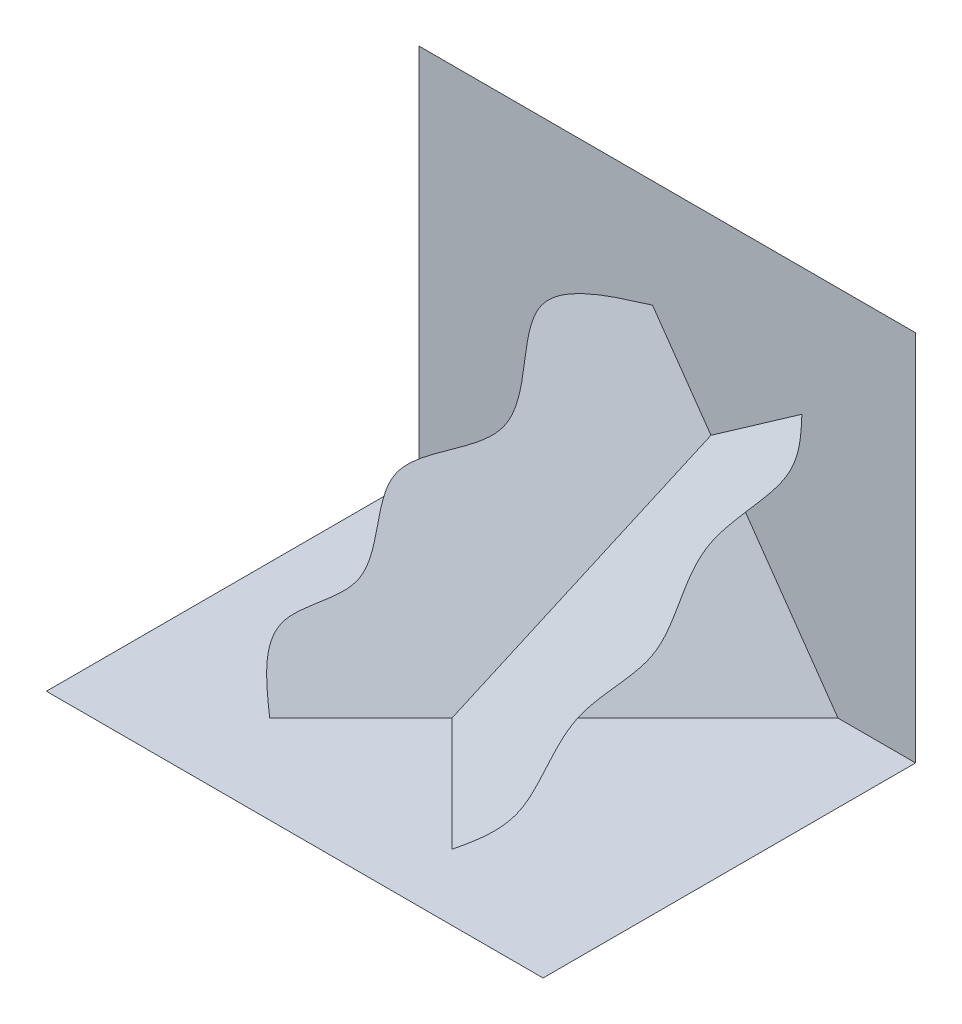
ISO-10303-21;
HEADER;
FILE_DESCRIPTION(('STEP AP214'),'2;1');
FILE_NAME('part.step','',(''),(''),'','','');
FILE_SCHEMA(('AUTOMOTIVE_DESIGN { 1 0 10303 214 1 1 1 1 }'));
ENDSEC;
DATA;
#1=APPLICATION_CONTEXT('core data for automotive mechanical design processes');
#2=APPLICATION_PROTOCOL_DEFINITION('international standard','automotive_design',2000,#1);
#3=PRODUCT_CONTEXT('',#1,'mechanical');
#4=PRODUCT('Part','Part','',(#3));
#5=PRODUCT_RELATED_PRODUCT_CATEGORY('part','',(#4));
#6=PRODUCT_DEFINITION_FORMATION('','',#4);
#7=PRODUCT_DEFINITION_CONTEXT('part definition',#1,'design');
#8=PRODUCT_DEFINITION('design','',#6,#7);
#9=PRODUCT_DEFINITION_SHAPE('','',#8);
#10=(LENGTH_UNIT() NAMED_UNIT(*) SI_UNIT(.MILLI.,.METRE.));
#11=(NAMED_UNIT(*) PLANE_ANGLE_UNIT() SI_UNIT($,.RADIAN.));
#12=(NAMED_UNIT(*) SI_UNIT($,.STERADIAN.) SOLID_ANGLE_UNIT());
#13=UNCERTAINTY_MEASURE_WITH_UNIT(LENGTH_MEASURE(1.E-05),#10,'distance_accuracy_value','');
#14=(GEOMETRIC_REPRESENTATION_CONTEXT(3) GLOBAL_UNCERTAINTY_ASSIGNED_CONTEXT((#13)) GLOBAL_UNIT_ASSIGNED_CONTEXT((#10,
#11,#12)) REPRESENTATION_CONTEXT('',''));
#15=CARTESIAN_POINT('',(0.,0.,0.));
#16=DIRECTION('',(0.,0.,1.));
#17=DIRECTION('',(1.,0.,0.));
#18=AXIS2_PLACEMENT_3D('',#15,#16,#17);
#19=CARTESIAN_POINT('',(-66.2620458647592,26.8489548000047,3.35814875180777));
#20=DIRECTION('',(0.241844762647977,0.664463024388675,-0.707106781186547));
#21=DIRECTION('',(0.,0.728739444818682,0.684791078771737));
#22=AXIS2_PLACEMENT_3D('',#19,#20,#21);
#23=PLANE('',#22);
#24=DIRECTION('',(-0.970314954424461,0.165613135909002,-0.176241818064393));
#25=VECTOR('',#24,1.);
#26=CARTESIAN_POINT('',(32.8254825642083,14.5762783450916,25.7155359248949));
#27=LINE('',#26,#25);
#28=CARTESIAN_POINT('',(32.8254825642083,14.5762783450916,25.7155359248949));
#29=VERTEX_POINT('',#28);
#30=CARTESIAN_POINT('',(-35.9189228439686,26.3095578374199,13.2292406909118));
#31=VERTEX_POINT('',#30);
#32=EDGE_CURVE('E81',#29,#31,#27,.T.);
#33=ORIENTED_EDGE('',*,*,#32,.T.);
#34=DIRECTION('',(0.833043972934897,0.231487773097027,0.502445171201219));
#35=VECTOR('',#34,1.);
#36=CARTESIAN_POINT('',(-35.9189228439686,26.3095578374199,13.2292406909118));
#37=LINE('',#36,#35);
#38=CARTESIAN_POINT('',(4.69642747711097,37.5958251952621,37.726130781331));
#39=VERTEX_POINT('',#38);
#40=EDGE_CURVE('E77',#31,#39,#37,.T.);
#41=ORIENTED_EDGE('',*,*,#40,.T.);
#42=DIRECTION('',(0.734813955546227,-0.601338517183763,-0.313752192798299));
#43=VECTOR('',#42,1.);
#44=CARTESIAN_POINT('',(4.69642747711098,37.5958251952621,37.726130781331));
#45=LINE('',#44,#43);
#46=EDGE_CURVE('E14',#39,#29,#45,.T.);
#47=ORIENTED_EDGE('',*,*,#46,.T.);
#48=EDGE_LOOP('',(#33,#41,#47));
#49=FACE_BOUND('',#48,.T.);
#50=ADVANCED_FACE('F71',(#49),#23,.T.);
#51=OPEN_SHELL('',(#50));
#52=SHELL_BASED_SURFACE_MODEL('B2',(#51));
#53=CARTESIAN_POINT('',(36.7570789771264,0.,123.479185095785));
#54=DIRECTION('',(0.497542812164521,-0.710564775461631,-0.497542812164523));
#55=DIRECTION('',(0.109657042945056,0.62049687008648,-0.776504325258674));
#56=AXIS2_PLACEMENT_3D('',#53,#54,#55);
#57=PLANE('',#56);
#58=CARTESIAN_POINT('',(36.7570789771264,0.,123.479185095785));
#59=CARTESIAN_POINT('',(45.7935676640745,7.12507062023506,122.340018378547));
#60=CARTESIAN_POINT('',(64.6600893419616,22.0009039189917,119.961648382187));
#61=CARTESIAN_POINT('',(42.1865609116284,31.7775381264274,83.5256392958579));
#62=CARTESIAN_POINT('',(65.4995856832867,51.5763304877276,78.5630582208244));
#63=CARTESIAN_POINT('',(66.0684059283905,57.3378239376939,70.903613079501));
#64=CARTESIAN_POINT('',(65.8490950029996,63.8778359657677,61.344197012147));
#65=CARTESIAN_POINT('',(42.5836374044887,66.33905750005,34.5637507853));
#66=CARTESIAN_POINT('',(77.3757496770937,97.9750823769855,24.1749371886657));
#67=CARTESIAN_POINT('',(61.3846483981035,98.4551408340038,7.49824138116505));
#68=CARTESIAN_POINT('',(54.1946667180037,98.670986600416,0.));
#69=B_SPLINE_CURVE_WITH_KNOTS('',3,(#58,#59,#60,#61,#62,#63,#64,#65,#66,#67,#68),.UNSPECIFIED.,
.F.,.F.,(4,1,1,1,2,1,1,4),(0.,0.154499840866,0.322567171598255,0.486588524749698,0.5,
0.698619407107819,0.864492075697165,1.),.UNSPECIFIED.);
#70=CARTESIAN_POINT('',(54.1946667180038,98.670986600416,0.));
#71=VERTEX_POINT('',#70);
#72=CARTESIAN_POINT('',(36.7570789771264,0.,123.479185095785));
#73=VERTEX_POINT('',#72);
#74=EDGE_CURVE('E69',#71,#73,#69,.F.);
#75=ORIENTED_EDGE('',*,*,#74,.T.);
#76=DIRECTION('',(0.707106781186546,0.,0.707106781186549));
#77=VECTOR('',#76,1.);
#78=CARTESIAN_POINT('',(-86.7221061186579,0.,0.));
#79=LINE('',#78,#77);
#80=CARTESIAN_POINT('',(-86.7221061186579,0.,0.));
#81=VERTEX_POINT('',#80);
#82=EDGE_CURVE('E128',#81,#73,#79,.T.);
#83=ORIENTED_EDGE('',*,*,#82,.F.);
#84=DIRECTION('',(0.819152044288991,0.573576436351047,0.));
#85=VECTOR('',#84,1.);
#86=CARTESIAN_POINT('',(-86.7221061186579,0.,0.));
#87=LINE('',#86,#85);
#88=EDGE_CURVE('E133',#81,#71,#87,.T.);
#89=ORIENTED_EDGE('',*,*,#88,.T.);
#90=EDGE_LOOP('',(#75,#83,#89));
#91=FACE_BOUND('',#90,.T.);
#92=ADVANCED_FACE('F119',(#91),#57,.T.);
#93=OPEN_SHELL('',(#92));
#94=SHELL_BASED_SURFACE_MODEL('B8',(#93));
#95=CARTESIAN_POINT('',(-5.94316366939032,106.669234561139,0.));
#96=DIRECTION('',(-0.633687274224638,-0.44371260627966,-0.633687274224645));
#97=DIRECTION('',(-0.246126866639404,-0.660944072912781,0.708924888827959));
#98=AXIS2_PLACEMENT_3D('',#95,#96,#97);
#99=PLANE('',#98);
#100=DIRECTION('',(0.57357643635105,-0.819152044288989,0.));
#101=VECTOR('',#100,1.);
#102=CARTESIAN_POINT('',(-5.94316366939032,106.669234561139,0.));
#103=LINE('',#102,#101);
#104=CARTESIAN_POINT('',(-5.94316366939033,106.669234561139,0.));
#105=VERTEX_POINT('',#104);
#106=CARTESIAN_POINT('',(17.5995241340649,73.0467919012829,0.));
#107=VERTEX_POINT('',#106);
#108=EDGE_CURVE('E202',#105,#107,#103,.T.);
#109=ORIENTED_EDGE('',*,*,#108,.T.);
#110=DIRECTION('',(-0.241844762647978,-0.664463024388674,0.707106781186547));
#111=VECTOR('',#110,1.);
#112=CARTESIAN_POINT('',(21.6255608624695,84.1082369024693,-11.7713439017274));
#113=LINE('',#112,#111);
#114=CARTESIAN_POINT('',(-8.98733382663985,0.,77.7347722920187));
#115=VERTEX_POINT('',#114);
#116=EDGE_CURVE('E117',#107,#115,#113,.T.);
#117=ORIENTED_EDGE('',*,*,#116,.T.);
#118=DIRECTION('',(-0.707106781186551,0.,0.707106781186544));
#119=VECTOR('',#118,1.);
#120=CARTESIAN_POINT('',(68.7474384653797,0.,0.));
#121=LINE('',#120,#119);
#122=CARTESIAN_POINT('',(-45.6653815473034,0.,114.412820012682));
#123=VERTEX_POINT('',#122);
#124=EDGE_CURVE('E205',#115,#123,#121,.T.);
#125=ORIENTED_EDGE('',*,*,#124,.T.);
#126=CARTESIAN_POINT('',(-5.94316366939032,106.669234561139,0.));
#127=CARTESIAN_POINT('',(-16.2225003343709,109.332282466204,8.41465044724047));
#128=CARTESIAN_POINT('',(-37.9936620255477,114.972495295309,26.2364925983703));
#129=CARTESIAN_POINT('',(-16.1311336223363,70.9052233678154,35.2302001871275));
#130=CARTESIAN_POINT('',(-34.3990219610904,69.7988618424903,54.2727712058993));
#131=CARTESIAN_POINT('',(-40.5688561232291,66.0327857501872,63.0796402373399));
#132=CARTESIAN_POINT('',(-46.5086778154872,60.2635079626441,73.0591537264614));
#133=CARTESIAN_POINT('',(-32.7285016797401,31.9549042086657,79.1008753354419));
#134=CARTESIAN_POINT('',(-57.8340172264083,28.25780428639,106.795128117202));
#135=CARTESIAN_POINT('',(-49.9141153863139,9.8663393706395,111.753068649835));
#136=CARTESIAN_POINT('',(-45.6653815473034,0.,114.412820012682));
#137=B_SPLINE_CURVE_WITH_KNOTS('',3,(#126,#127,#128,#129,#130,#131,#132,#133,#134,#135,#136),
.UNSPECIFIED.,.F.,.F.,(4,1,1,2,1,1,1,4),(0.,0.171196663167747,0.362586648952993,0.5,
0.544005285622462,0.719119501261258,0.849318021384061,1.),.UNSPECIFIED.);
#138=EDGE_CURVE('E180',#123,#105,#137,.F.);
#139=ORIENTED_EDGE('',*,*,#138,.T.);
#140=EDGE_LOOP('',(#109,#117,#125,#139));
#141=FACE_BOUND('',#140,.T.);
#142=ADVANCED_FACE('F175',(#141),#99,.T.);
#143=ORIENTED_EDGE('',*,*,#116,.F.);
#144=CARTESIAN_POINT('',(68.7474384653797,0.,0.));
#145=VERTEX_POINT('',#144);
#146=EDGE_CURVE('E198',#107,#145,#103,.T.);
#147=ORIENTED_EDGE('',*,*,#146,.T.);
#148=EDGE_CURVE('E200',#145,#115,#121,.T.);
#149=ORIENTED_EDGE('',*,*,#148,.T.);
#150=EDGE_LOOP('',(#143,#147,#149));
#151=FACE_BOUND('',#150,.T.);
#152=ADVANCED_FACE('F176',(#151),#99,.T.);
#153=OPEN_SHELL('',(#142,#152));
#154=SHELL_BASED_SURFACE_MODEL('B63',(#153));
#155=CARTESIAN_POINT('',(-100.,-0.0001,0.));
#156=DIRECTION('',(-1.,0.,0.));
#157=DIRECTION('',(0.,0.,1.));
#158=AXIS2_PLACEMENT_3D('',#155,#156,#157);
#159=PLANE('',#158);
#160=DIRECTION('',(0.,0.,1.));
#161=VECTOR('',#160,1.);
#162=CARTESIAN_POINT('',(-100.,0.,0.));
#163=LINE('',#162,#161);
#164=CARTESIAN_POINT('',(-100.,0.,0.));
#165=VERTEX_POINT('',#164);
#166=CARTESIAN_POINT('',(-100.,0.,150.));
#167=VERTEX_POINT('',#166);
#168=EDGE_CURVE('E298',#165,#167,#163,.T.);
#169=ORIENTED_EDGE('',*,*,#168,.F.);
#170=DIRECTION('',(0.,1.,0.));
#171=VECTOR('',#170,1.);
#172=CARTESIAN_POINT('',(-100.,-0.0001,0.));
#173=LINE('',#172,#171);
#174=CARTESIAN_POINT('',(-100.,-0.0001,0.));
#175=VERTEX_POINT('',#174);
#176=EDGE_CURVE('E173',#175,#165,#173,.T.);
#177=ORIENTED_EDGE('',*,*,#176,.F.);
#178=DIRECTION('',(0.,0.,1.));
#179=VECTOR('',#178,1.);
#180=CARTESIAN_POINT('',(-100.,-0.0001,0.));
#181=LINE('',#180,#179);
#182=CARTESIAN_POINT('',(-100.,-0.0001,150.));
#183=VERTEX_POINT('',#182);
#184=EDGE_CURVE('E300',#175,#183,#181,.T.);
#185=ORIENTED_EDGE('',*,*,#184,.T.);
#186=DIRECTION('',(0.,1.,0.));
#187=VECTOR('',#186,1.);
#188=CARTESIAN_POINT('',(-100.,-0.0001,150.));
#189=LINE('',#188,#187);
#190=EDGE_CURVE('E261',#183,#167,#189,.T.);
#191=ORIENTED_EDGE('',*,*,#190,.T.);
#192=EDGE_LOOP('',(#169,#177,#185,#191));
#193=FACE_BOUND('',#192,.T.);
#194=ADVANCED_FACE('F258',(#193),#159,.T.);
#195=CARTESIAN_POINT('',(-100.,-0.0001,0.));
#196=DIRECTION('',(0.,0.,-1.));
#197=DIRECTION('',(-1.,0.,0.));
#198=AXIS2_PLACEMENT_3D('',#195,#196,#197);
#199=PLANE('',#198);
#200=DIRECTION('',(-1.,0.,0.));
#201=VECTOR('',#200,1.);
#202=CARTESIAN_POINT('',(-100.,0.,0.));
#203=LINE('',#202,#201);
#204=CARTESIAN_POINT('',(100.,0.,0.));
#205=VERTEX_POINT('',#204);
#206=EDGE_CURVE('E315',#205,#165,#203,.T.);
#207=ORIENTED_EDGE('',*,*,#206,.F.);
#208=DIRECTION('',(0.,1.,0.));
#209=VECTOR('',#208,1.);
#210=CARTESIAN_POINT('',(100.,-0.0001,0.));
#211=LINE('',#210,#209);
#212=CARTESIAN_POINT('',(100.,-0.0001,0.));
#213=VERTEX_POINT('',#212);
#214=EDGE_CURVE('E266',#213,#205,#211,.T.);
#215=ORIENTED_EDGE('',*,*,#214,.F.);
#216=DIRECTION('',(-1.,0.,0.));
#217=VECTOR('',#216,1.);
#218=CARTESIAN_POINT('',(-100.,-0.0001,0.));
#219=LINE('',#218,#217);
#220=EDGE_CURVE('E305',#213,#175,#219,.T.);
#221=ORIENTED_EDGE('',*,*,#220,.T.);
#222=ORIENTED_EDGE('',*,*,#176,.T.);
#223=EDGE_LOOP('',(#207,#215,#221,#222));
#224=FACE_BOUND('',#223,.T.);
#225=ADVANCED_FACE('F330',(#224),#199,.T.);
#226=CARTESIAN_POINT('',(100.,-0.0001,0.));
#227=DIRECTION('',(1.,0.,0.));
#228=DIRECTION('',(0.,0.,-1.));
#229=AXIS2_PLACEMENT_3D('',#226,#227,#228);
#230=PLANE('',#229);
#231=DIRECTION('',(0.,0.,-1.));
#232=VECTOR('',#231,1.);
#233=CARTESIAN_POINT('',(100.,0.,0.));
#234=LINE('',#233,#232);
#235=CARTESIAN_POINT('',(100.,0.,150.));
#236=VERTEX_POINT('',#235);
#237=EDGE_CURVE('E312',#236,#205,#234,.T.);
#238=ORIENTED_EDGE('',*,*,#237,.F.);
#239=DIRECTION('',(0.,1.,0.));
#240=VECTOR('',#239,1.);
#241=CARTESIAN_POINT('',(100.,-0.0001,150.));
#242=LINE('',#241,#240);
#243=CARTESIAN_POINT('',(100.,-0.0001,150.));
#244=VERTEX_POINT('',#243);
#245=EDGE_CURVE('E304',#244,#236,#242,.T.);
#246=ORIENTED_EDGE('',*,*,#245,.F.);
#247=DIRECTION('',(0.,0.,-1.));
#248=VECTOR('',#247,1.);
#249=CARTESIAN_POINT('',(100.,-0.0001,0.));
#250=LINE('',#249,#248);
#251=EDGE_CURVE('E323',#244,#213,#250,.T.);
#252=ORIENTED_EDGE('',*,*,#251,.T.);
#253=ORIENTED_EDGE('',*,*,#214,.T.);
#254=EDGE_LOOP('',(#238,#246,#252,#253));
#255=FACE_BOUND('',#254,.T.);
#256=ADVANCED_FACE('F327',(#255),#230,.T.);
#257=CARTESIAN_POINT('',(-100.,-0.0001,150.));
#258=DIRECTION('',(0.,0.,1.));
#259=DIRECTION('',(1.,0.,0.));
#260=AXIS2_PLACEMENT_3D('',#257,#258,#259);
#261=PLANE('',#260);
#262=DIRECTION('',(1.,0.,0.));
#263=VECTOR('',#262,1.);
#264=CARTESIAN_POINT('',(-100.,0.,150.));
#265=LINE('',#264,#263);
#266=EDGE_CURVE('E307',#167,#236,#265,.T.);
#267=ORIENTED_EDGE('',*,*,#266,.F.);
#268=ORIENTED_EDGE('',*,*,#190,.F.);
#269=DIRECTION('',(1.,0.,0.));
#270=VECTOR('',#269,1.);
#271=CARTESIAN_POINT('',(-100.,-0.0001,150.));
#272=LINE('',#271,#270);
#273=EDGE_CURVE('E321',#183,#244,#272,.T.);
#274=ORIENTED_EDGE('',*,*,#273,.T.);
#275=ORIENTED_EDGE('',*,*,#245,.T.);
#276=EDGE_LOOP('',(#267,#268,#274,#275));
#277=FACE_BOUND('',#276,.T.);
#278=ADVANCED_FACE('F308',(#277),#261,.T.);
#279=CARTESIAN_POINT('',(-100.,-0.0001,0.));
#280=DIRECTION('',(0.,1.,0.));
#281=DIRECTION('',(0.,0.,1.));
#282=AXIS2_PLACEMENT_3D('',#279,#280,#281);
#283=PLANE('',#282);
#284=ORIENTED_EDGE('',*,*,#184,.F.);
#285=ORIENTED_EDGE('',*,*,#220,.F.);
#286=ORIENTED_EDGE('',*,*,#251,.F.);
#287=ORIENTED_EDGE('',*,*,#273,.F.);
#288=EDGE_LOOP('',(#284,#285,#286,#287));
#289=FACE_BOUND('',#288,.T.);
#290=ADVANCED_FACE('F332',(#289),#283,.F.);
#291=CARTESIAN_POINT('',(-100.,0.,0.));
#292=DIRECTION('',(0.,1.,0.));
#293=DIRECTION('',(0.,0.,1.));
#294=AXIS2_PLACEMENT_3D('',#291,#292,#293);
#295=PLANE('',#294);
#296=ORIENTED_EDGE('',*,*,#168,.T.);
#297=ORIENTED_EDGE('',*,*,#266,.T.);
#298=ORIENTED_EDGE('',*,*,#237,.T.);
#299=ORIENTED_EDGE('',*,*,#206,.T.);
#300=EDGE_LOOP('',(#296,#297,#298,#299));
#301=FACE_BOUND('',#300,.T.);
#302=ADVANCED_FACE('F314',(#301),#295,.T.);
#303=CLOSED_SHELL('',(#194,#225,#256,#278,#290,#302));
#304=MANIFOLD_SOLID_BREP('B111',#303);
#305=CARTESIAN_POINT('',(-100.,150.,-0.0001));
#306=DIRECTION('',(-1.,0.,0.));
#307=DIRECTION('',(0.,-1.,0.));
#308=AXIS2_PLACEMENT_3D('',#305,#306,#307);
#309=PLANE('',#308);
#310=DIRECTION('',(0.,-1.,0.));
#311=VECTOR('',#310,1.);
#312=CARTESIAN_POINT('',(-100.,150.,0.));
#313=LINE('',#312,#311);
#314=CARTESIAN_POINT('',(-100.,150.,0.));
#315=VERTEX_POINT('',#314);
#316=CARTESIAN_POINT('',(-100.,0.,0.));
#317=VERTEX_POINT('',#316);
#318=EDGE_CURVE('E409',#315,#317,#313,.T.);
#319=ORIENTED_EDGE('',*,*,#318,.F.);
#320=DIRECTION('',(0.,0.,1.));
#321=VECTOR('',#320,1.);
#322=CARTESIAN_POINT('',(-100.,150.,-0.0001));
#323=LINE('',#322,#321);
#324=CARTESIAN_POINT('',(-100.,150.,-0.0001));
#325=VERTEX_POINT('',#324);
#326=EDGE_CURVE('E256',#325,#315,#323,.T.);
#327=ORIENTED_EDGE('',*,*,#326,.F.);
#328=DIRECTION('',(0.,-1.,0.));
#329=VECTOR('',#328,1.);
#330=CARTESIAN_POINT('',(-100.,150.,-0.0001));
#331=LINE('',#330,#329);
#332=CARTESIAN_POINT('',(-100.,0.,-0.0001));
#333=VERTEX_POINT('',#332);
#334=EDGE_CURVE('E411',#325,#333,#331,.T.);
#335=ORIENTED_EDGE('',*,*,#334,.T.);
#336=DIRECTION('',(0.,0.,1.));
#337=VECTOR('',#336,1.);
#338=CARTESIAN_POINT('',(-100.,0.,-0.0001));
#339=LINE('',#338,#337);
#340=EDGE_CURVE('E372',#333,#317,#339,.T.);
#341=ORIENTED_EDGE('',*,*,#340,.T.);
#342=EDGE_LOOP('',(#319,#327,#335,#341));
#343=FACE_BOUND('',#342,.T.);
#344=ADVANCED_FACE('F369',(#343),#309,.T.);
#345=CARTESIAN_POINT('',(-100.,150.,-0.0001));
#346=DIRECTION('',(0.,1.,0.));
#347=DIRECTION('',(0.,0.,1.));
#348=AXIS2_PLACEMENT_3D('',#345,#346,#347);
#349=PLANE('',#348);
#350=DIRECTION('',(-1.,0.,0.));
#351=VECTOR('',#350,1.);
#352=CARTESIAN_POINT('',(-100.,150.,0.));
#353=LINE('',#352,#351);
#354=CARTESIAN_POINT('',(100.,150.,0.));
#355=VERTEX_POINT('',#354);
#356=EDGE_CURVE('E426',#355,#315,#353,.T.);
#357=ORIENTED_EDGE('',*,*,#356,.F.);
#358=DIRECTION('',(0.,0.,1.));
#359=VECTOR('',#358,1.);
#360=CARTESIAN_POINT('',(100.,150.,-0.0001));
#361=LINE('',#360,#359);
#362=CARTESIAN_POINT('',(100.,150.,-0.0001));
#363=VERTEX_POINT('',#362);
#364=EDGE_CURVE('E377',#363,#355,#361,.T.);
#365=ORIENTED_EDGE('',*,*,#364,.F.);
#366=DIRECTION('',(-1.,0.,0.));
#367=VECTOR('',#366,1.);
#368=CARTESIAN_POINT('',(-100.,150.,-0.0001));
#369=LINE('',#368,#367);
#370=EDGE_CURVE('E416',#363,#325,#369,.T.);
#371=ORIENTED_EDGE('',*,*,#370,.T.);
#372=ORIENTED_EDGE('',*,*,#326,.T.);
#373=EDGE_LOOP('',(#357,#365,#371,#372));
#374=FACE_BOUND('',#373,.T.);
#375=ADVANCED_FACE('F441',(#374),#349,.T.);
#376=CARTESIAN_POINT('',(100.,150.,-0.0001));
#377=DIRECTION('',(1.,0.,0.));
#378=DIRECTION('',(0.,1.,0.));
#379=AXIS2_PLACEMENT_3D('',#376,#377,#378);
#380=PLANE('',#379);
#381=DIRECTION('',(0.,1.,0.));
#382=VECTOR('',#381,1.);
#383=CARTESIAN_POINT('',(100.,150.,0.));
#384=LINE('',#383,#382);
#385=CARTESIAN_POINT('',(100.,0.,0.));
#386=VERTEX_POINT('',#385);
#387=EDGE_CURVE('E423',#386,#355,#384,.T.);
#388=ORIENTED_EDGE('',*,*,#387,.F.);
#389=DIRECTION('',(0.,0.,1.));
#390=VECTOR('',#389,1.);
#391=CARTESIAN_POINT('',(100.,0.,-0.0001));
#392=LINE('',#391,#390);
#393=CARTESIAN_POINT('',(100.,0.,-0.0001));
#394=VERTEX_POINT('',#393);
#395=EDGE_CURVE('E415',#394,#386,#392,.T.);
#396=ORIENTED_EDGE('',*,*,#395,.F.);
#397=DIRECTION('',(0.,1.,0.));
#398=VECTOR('',#397,1.);
#399=CARTESIAN_POINT('',(100.,150.,-0.0001));
#400=LINE('',#399,#398);
#401=EDGE_CURVE('E434',#394,#363,#400,.T.);
#402=ORIENTED_EDGE('',*,*,#401,.T.);
#403=ORIENTED_EDGE('',*,*,#364,.T.);
#404=EDGE_LOOP('',(#388,#396,#402,#403));
#405=FACE_BOUND('',#404,.T.);
#406=ADVANCED_FACE('F438',(#405),#380,.T.);
#407=CARTESIAN_POINT('',(-100.,0.,-0.0001));
#408=DIRECTION('',(0.,-1.,0.));
#409=DIRECTION('',(0.,0.,-1.));
#410=AXIS2_PLACEMENT_3D('',#407,#408,#409);
#411=PLANE('',#410);
#412=DIRECTION('',(1.,0.,0.));
#413=VECTOR('',#412,1.);
#414=CARTESIAN_POINT('',(-100.,0.,0.));
#415=LINE('',#414,#413);
#416=EDGE_CURVE('E418',#317,#386,#415,.T.);
#417=ORIENTED_EDGE('',*,*,#416,.F.);
#418=ORIENTED_EDGE('',*,*,#340,.F.);
#419=DIRECTION('',(1.,0.,0.));
#420=VECTOR('',#419,1.);
#421=CARTESIAN_POINT('',(-100.,0.,-0.0001));
#422=LINE('',#421,#420);
#423=EDGE_CURVE('E432',#333,#394,#422,.T.);
#424=ORIENTED_EDGE('',*,*,#423,.T.);
#425=ORIENTED_EDGE('',*,*,#395,.T.);
#426=EDGE_LOOP('',(#417,#418,#424,#425));
#427=FACE_BOUND('',#426,.T.);
#428=ADVANCED_FACE('F419',(#427),#411,.T.);
#429=CARTESIAN_POINT('',(-100.,0.,-0.0001));
#430=DIRECTION('',(0.,0.,1.));
#431=DIRECTION('',(1.,0.,0.));
#432=AXIS2_PLACEMENT_3D('',#429,#430,#431);
#433=PLANE('',#432);
#434=ORIENTED_EDGE('',*,*,#334,.F.);
#435=ORIENTED_EDGE('',*,*,#370,.F.);
#436=ORIENTED_EDGE('',*,*,#401,.F.);
#437=ORIENTED_EDGE('',*,*,#423,.F.);
#438=EDGE_LOOP('',(#434,#435,#436,#437));
#439=FACE_BOUND('',#438,.T.);
#440=ADVANCED_FACE('F443',(#439),#433,.F.);
#441=CARTESIAN_POINT('',(-100.,0.,0.));
#442=DIRECTION('',(0.,0.,1.));
#443=DIRECTION('',(1.,0.,0.));
#444=AXIS2_PLACEMENT_3D('',#441,#442,#443);
#445=PLANE('',#444);
#446=ORIENTED_EDGE('',*,*,#318,.T.);
#447=ORIENTED_EDGE('',*,*,#416,.T.);
#448=ORIENTED_EDGE('',*,*,#387,.T.);
#449=ORIENTED_EDGE('',*,*,#356,.T.);
#450=EDGE_LOOP('',(#446,#447,#448,#449));
#451=FACE_BOUND('',#450,.T.);
#452=ADVANCED_FACE('F425',(#451),#445,.T.);
#453=CLOSED_SHELL('',(#344,#375,#406,#428,#440,#452));
#454=MANIFOLD_SOLID_BREP('B167',#453);
#455=ADVANCED_BREP_SHAPE_REPRESENTATION('',(#18,#304,#454),#14);
#456=MANIFOLD_SURFACE_SHAPE_REPRESENTATION('',(#18,#52,#94,#154),#14);
#457=SHAPE_REPRESENTATION('',(#18),#14);
#458=SHAPE_DEFINITION_REPRESENTATION(#9,#457);
#459=SHAPE_REPRESENTATION_RELATIONSHIP('','',#457,#455);
#460=SHAPE_REPRESENTATION_RELATIONSHIP('','',#457,#456);
ENDSEC;
END-ISO-10303-21;
